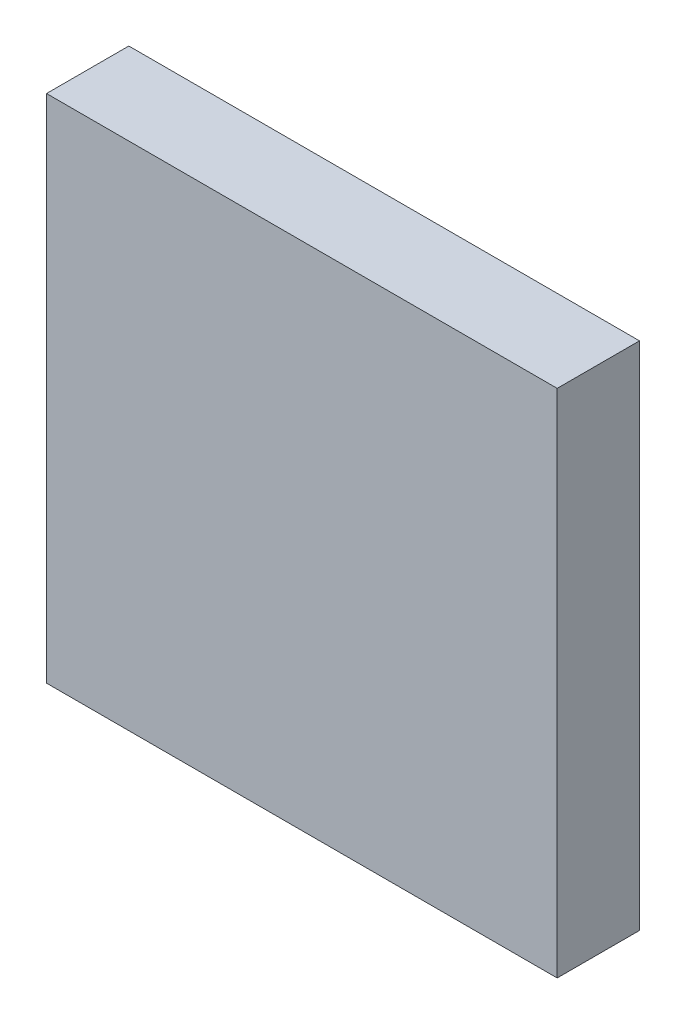
ISO-10303-21;
HEADER;
FILE_DESCRIPTION(('STEP AP214'),'2;1');
FILE_NAME('part.step','',(''),(''),'','','');
FILE_SCHEMA(('AUTOMOTIVE_DESIGN { 1 0 10303 214 1 1 1 1 }'));
ENDSEC;
DATA;
#1=APPLICATION_CONTEXT('core data for automotive mechanical design processes');
#2=APPLICATION_PROTOCOL_DEFINITION('international standard','automotive_design',2000,#1);
#3=PRODUCT_CONTEXT('',#1,'mechanical');
#4=PRODUCT('Part','Part','',(#3));
#5=PRODUCT_RELATED_PRODUCT_CATEGORY('part','',(#4));
#6=PRODUCT_DEFINITION_FORMATION('','',#4);
#7=PRODUCT_DEFINITION_CONTEXT('part definition',#1,'design');
#8=PRODUCT_DEFINITION('design','',#6,#7);
#9=PRODUCT_DEFINITION_SHAPE('','',#8);
#10=(LENGTH_UNIT() NAMED_UNIT(*) SI_UNIT(.MILLI.,.METRE.));
#11=(NAMED_UNIT(*) PLANE_ANGLE_UNIT() SI_UNIT($,.RADIAN.));
#12=(NAMED_UNIT(*) SI_UNIT($,.STERADIAN.) SOLID_ANGLE_UNIT());
#13=UNCERTAINTY_MEASURE_WITH_UNIT(LENGTH_MEASURE(1.E-05),#10,'distance_accuracy_value','');
#14=(GEOMETRIC_REPRESENTATION_CONTEXT(3) GLOBAL_UNCERTAINTY_ASSIGNED_CONTEXT((#13)) GLOBAL_UNIT_ASSIGNED_CONTEXT((#10,
#11,#12)) REPRESENTATION_CONTEXT('',''));
#15=CARTESIAN_POINT('',(0.,0.,0.));
#16=DIRECTION('',(0.,0.,1.));
#17=DIRECTION('',(1.,0.,0.));
#18=AXIS2_PLACEMENT_3D('',#15,#16,#17);
#19=CARTESIAN_POINT('',(3.475,-3.475,-2.12));
#20=DIRECTION('',(1.,0.,0.));
#21=DIRECTION('',(0.,1.,0.));
#22=AXIS2_PLACEMENT_3D('',#19,#20,#21);
#23=PLANE('',#22);
#24=DIRECTION('',(0.,-1.,0.));
#25=VECTOR('',#24,1.);
#26=CARTESIAN_POINT('',(3.475,3.475,-2.12));
#27=LINE('',#26,#25);
#28=CARTESIAN_POINT('',(3.475,3.475,-2.12));
#29=VERTEX_POINT('',#28);
#30=CARTESIAN_POINT('',(3.475,-3.475,-2.12));
#31=VERTEX_POINT('',#30);
#32=EDGE_CURVE('E113',#29,#31,#27,.T.);
#33=ORIENTED_EDGE('',*,*,#32,.F.);
#34=DIRECTION('',(0.,0.,1.));
#35=VECTOR('',#34,1.);
#36=CARTESIAN_POINT('',(3.475,3.475,-2.12));
#37=LINE('',#36,#35);
#38=CARTESIAN_POINT('',(3.475,3.475,-1.));
#39=VERTEX_POINT('',#38);
#40=EDGE_CURVE('E59',#29,#39,#37,.T.);
#41=ORIENTED_EDGE('',*,*,#40,.T.);
#42=DIRECTION('',(0.,1.,0.));
#43=VECTOR('',#42,1.);
#44=CARTESIAN_POINT('',(3.475,3.475,-1.));
#45=LINE('',#44,#43);
#46=CARTESIAN_POINT('',(3.475,-3.475,-1.));
#47=VERTEX_POINT('',#46);
#48=EDGE_CURVE('E98',#47,#39,#45,.T.);
#49=ORIENTED_EDGE('',*,*,#48,.F.);
#50=DIRECTION('',(0.,0.,1.));
#51=VECTOR('',#50,1.);
#52=CARTESIAN_POINT('',(3.475,-3.475,-2.12));
#53=LINE('',#52,#51);
#54=EDGE_CURVE('E11',#31,#47,#53,.T.);
#55=ORIENTED_EDGE('',*,*,#54,.F.);
#56=EDGE_LOOP('',(#33,#41,#49,#55));
#57=FACE_BOUND('',#56,.T.);
#58=ADVANCED_FACE('F16',(#57),#23,.T.);
#59=CARTESIAN_POINT('',(-3.475,-3.475,-2.12));
#60=DIRECTION('',(0.,-1.,0.));
#61=DIRECTION('',(0.,0.,-1.));
#62=AXIS2_PLACEMENT_3D('',#59,#60,#61);
#63=PLANE('',#62);
#64=DIRECTION('',(-1.,0.,0.));
#65=VECTOR('',#64,1.);
#66=CARTESIAN_POINT('',(3.475,-3.475,-2.12));
#67=LINE('',#66,#65);
#68=CARTESIAN_POINT('',(-3.475,-3.475,-2.12));
#69=VERTEX_POINT('',#68);
#70=EDGE_CURVE('E86',#31,#69,#67,.T.);
#71=ORIENTED_EDGE('',*,*,#70,.F.);
#72=ORIENTED_EDGE('',*,*,#54,.T.);
#73=DIRECTION('',(1.,0.,0.));
#74=VECTOR('',#73,1.);
#75=CARTESIAN_POINT('',(3.475,-3.475,-1.));
#76=LINE('',#75,#74);
#77=CARTESIAN_POINT('',(-3.475,-3.475,-1.));
#78=VERTEX_POINT('',#77);
#79=EDGE_CURVE('E105',#78,#47,#76,.T.);
#80=ORIENTED_EDGE('',*,*,#79,.F.);
#81=DIRECTION('',(0.,0.,1.));
#82=VECTOR('',#81,1.);
#83=CARTESIAN_POINT('',(-3.475,-3.475,-2.12));
#84=LINE('',#83,#82);
#85=EDGE_CURVE('E26',#69,#78,#84,.T.);
#86=ORIENTED_EDGE('',*,*,#85,.F.);
#87=EDGE_LOOP('',(#71,#72,#80,#86));
#88=FACE_BOUND('',#87,.T.);
#89=ADVANCED_FACE('F18',(#88),#63,.T.);
#90=CARTESIAN_POINT('',(-3.475,3.475,-2.12));
#91=DIRECTION('',(-1.,0.,0.));
#92=DIRECTION('',(0.,0.,1.));
#93=AXIS2_PLACEMENT_3D('',#90,#91,#92);
#94=PLANE('',#93);
#95=DIRECTION('',(0.,1.,0.));
#96=VECTOR('',#95,1.);
#97=CARTESIAN_POINT('',(-3.475,-3.475,-2.12));
#98=LINE('',#97,#96);
#99=CARTESIAN_POINT('',(-3.475,3.475,-2.12));
#100=VERTEX_POINT('',#99);
#101=EDGE_CURVE('E82',#69,#100,#98,.T.);
#102=ORIENTED_EDGE('',*,*,#101,.F.);
#103=ORIENTED_EDGE('',*,*,#85,.T.);
#104=DIRECTION('',(0.,-1.,0.));
#105=VECTOR('',#104,1.);
#106=CARTESIAN_POINT('',(-3.475,-3.475,-1.));
#107=LINE('',#106,#105);
#108=CARTESIAN_POINT('',(-3.475,3.475,-1.));
#109=VERTEX_POINT('',#108);
#110=EDGE_CURVE('E92',#109,#78,#107,.T.);
#111=ORIENTED_EDGE('',*,*,#110,.F.);
#112=DIRECTION('',(0.,0.,1.));
#113=VECTOR('',#112,1.);
#114=CARTESIAN_POINT('',(-3.475,3.475,-2.12));
#115=LINE('',#114,#113);
#116=EDGE_CURVE('E69',#100,#109,#115,.T.);
#117=ORIENTED_EDGE('',*,*,#116,.F.);
#118=EDGE_LOOP('',(#102,#103,#111,#117));
#119=FACE_BOUND('',#118,.T.);
#120=ADVANCED_FACE('F90',(#119),#94,.T.);
#121=CARTESIAN_POINT('',(0.,0.,-2.12));
#122=DIRECTION('',(0.,0.,1.));
#123=DIRECTION('',(1.,0.,0.));
#124=AXIS2_PLACEMENT_3D('',#121,#122,#123);
#125=PLANE('',#124);
#126=DIRECTION('',(1.,0.,0.));
#127=VECTOR('',#126,1.);
#128=CARTESIAN_POINT('',(-3.475,3.475,-2.12));
#129=LINE('',#128,#127);
#130=EDGE_CURVE('E85',#100,#29,#129,.T.);
#131=ORIENTED_EDGE('',*,*,#130,.T.);
#132=ORIENTED_EDGE('',*,*,#32,.T.);
#133=ORIENTED_EDGE('',*,*,#70,.T.);
#134=ORIENTED_EDGE('',*,*,#101,.T.);
#135=EDGE_LOOP('',(#131,#132,#133,#134));
#136=FACE_BOUND('',#135,.T.);
#137=ADVANCED_FACE('F83',(#136),#125,.F.);
#138=CARTESIAN_POINT('',(3.475,3.475,-2.12));
#139=DIRECTION('',(0.,1.,0.));
#140=DIRECTION('',(1.,0.,0.));
#141=AXIS2_PLACEMENT_3D('',#138,#139,#140);
#142=PLANE('',#141);
#143=ORIENTED_EDGE('',*,*,#130,.F.);
#144=ORIENTED_EDGE('',*,*,#116,.T.);
#145=DIRECTION('',(-1.,0.,0.));
#146=VECTOR('',#145,1.);
#147=CARTESIAN_POINT('',(-3.475,3.475,-1.));
#148=LINE('',#147,#146);
#149=EDGE_CURVE('E20',#39,#109,#148,.T.);
#150=ORIENTED_EDGE('',*,*,#149,.F.);
#151=ORIENTED_EDGE('',*,*,#40,.F.);
#152=EDGE_LOOP('',(#143,#144,#150,#151));
#153=FACE_BOUND('',#152,.T.);
#154=ADVANCED_FACE('F96',(#153),#142,.T.);
#155=CARTESIAN_POINT('',(0.,0.,-1.));
#156=DIRECTION('',(0.,0.,1.));
#157=DIRECTION('',(1.,0.,0.));
#158=AXIS2_PLACEMENT_3D('',#155,#156,#157);
#159=PLANE('',#158);
#160=ORIENTED_EDGE('',*,*,#149,.T.);
#161=ORIENTED_EDGE('',*,*,#110,.T.);
#162=ORIENTED_EDGE('',*,*,#79,.T.);
#163=ORIENTED_EDGE('',*,*,#48,.T.);
#164=EDGE_LOOP('',(#160,#161,#162,#163));
#165=FACE_BOUND('',#164,.T.);
#166=ADVANCED_FACE('F127',(#165),#159,.T.);
#167=CLOSED_SHELL('',(#58,#89,#120,#137,#154,#166));
#168=MANIFOLD_SOLID_BREP('B1',#167);
#169=ADVANCED_BREP_SHAPE_REPRESENTATION('',(#18,#168),#14);
#170=SHAPE_DEFINITION_REPRESENTATION(#9,#169);
ENDSEC;
END-ISO-10303-21;
